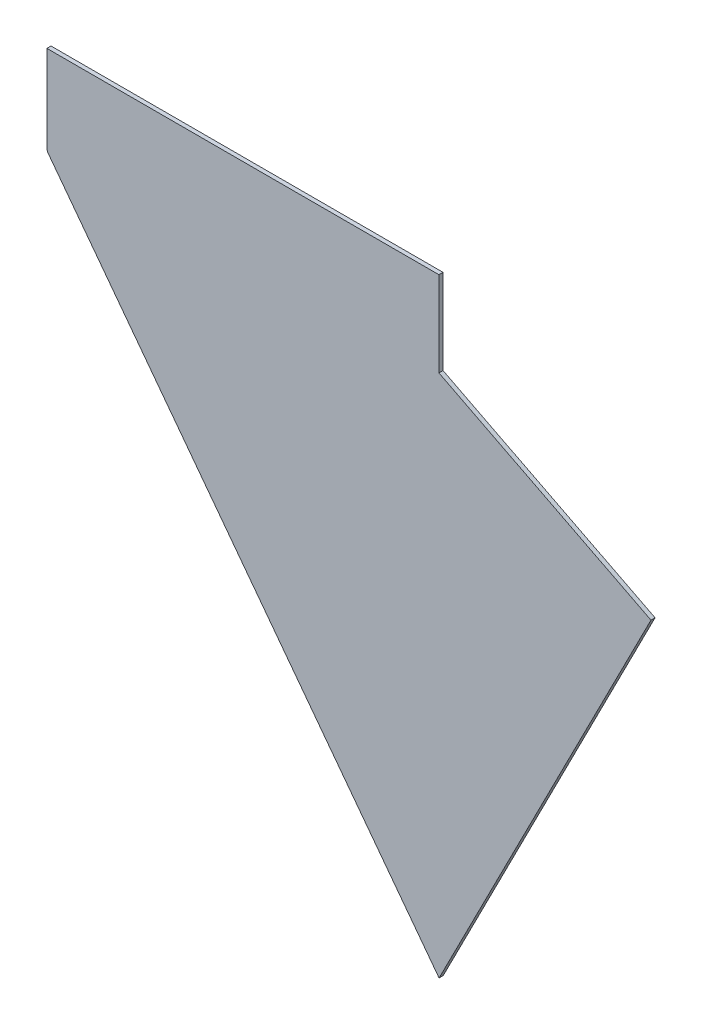
ISO-10303-21;
HEADER;
FILE_DESCRIPTION(('STEP AP214'),'2;1');
FILE_NAME('part.step','',(''),(''),'','','');
FILE_SCHEMA(('AUTOMOTIVE_DESIGN { 1 0 10303 214 1 1 1 1 }'));
ENDSEC;
DATA;
#1=APPLICATION_CONTEXT('core data for automotive mechanical design processes');
#2=APPLICATION_PROTOCOL_DEFINITION('international standard','automotive_design',2000,#1);
#3=PRODUCT_CONTEXT('',#1,'mechanical');
#4=PRODUCT('Part','Part','',(#3));
#5=PRODUCT_RELATED_PRODUCT_CATEGORY('part','',(#4));
#6=PRODUCT_DEFINITION_FORMATION('','',#4);
#7=PRODUCT_DEFINITION_CONTEXT('part definition',#1,'design');
#8=PRODUCT_DEFINITION('design','',#6,#7);
#9=PRODUCT_DEFINITION_SHAPE('','',#8);
#10=(LENGTH_UNIT() NAMED_UNIT(*) SI_UNIT(.MILLI.,.METRE.));
#11=(NAMED_UNIT(*) PLANE_ANGLE_UNIT() SI_UNIT($,.RADIAN.));
#12=(NAMED_UNIT(*) SI_UNIT($,.STERADIAN.) SOLID_ANGLE_UNIT());
#13=UNCERTAINTY_MEASURE_WITH_UNIT(LENGTH_MEASURE(1.E-05),#10,'distance_accuracy_value','');
#14=(GEOMETRIC_REPRESENTATION_CONTEXT(3) GLOBAL_UNCERTAINTY_ASSIGNED_CONTEXT((#13)) GLOBAL_UNIT_ASSIGNED_CONTEXT((#10,
#11,#12)) REPRESENTATION_CONTEXT('',''));
#15=CARTESIAN_POINT('',(0.,0.,0.));
#16=DIRECTION('',(0.,0.,1.));
#17=DIRECTION('',(1.,0.,0.));
#18=AXIS2_PLACEMENT_3D('',#15,#16,#17);
#19=CARTESIAN_POINT('',(-191.151037261948,302.462633045061,101.99999999542));
#20=DIRECTION('',(-0.948323655206207,-0.317304656405071,0.));
#21=DIRECTION('',(0.317304656405071,-0.948323655206206,0.));
#22=AXIS2_PLACEMENT_3D('',#19,#20,#21);
#23=PLANE('',#22);
#24=DIRECTION('',(0.,0.,1.));
#25=VECTOR('',#24,1.);
#26=CARTESIAN_POINT('',(-191.151037261948,302.462633045061,101.99999999542));
#27=LINE('',#26,#25);
#28=CARTESIAN_POINT('',(-191.151037261948,302.462633045061,99.9999999954202));
#29=VERTEX_POINT('',#28);
#30=CARTESIAN_POINT('',(-191.151037261948,302.462633045061,101.99999999542));
#31=VERTEX_POINT('',#30);
#32=EDGE_CURVE('E11',#29,#31,#27,.T.);
#33=ORIENTED_EDGE('',*,*,#32,.F.);
#34=DIRECTION('',(0.317304656405071,-0.948323655206206,0.));
#35=VECTOR('',#34,1.);
#36=CARTESIAN_POINT('',(-191.151037261948,302.462633045061,99.9999999954202));
#37=LINE('',#36,#35);
#38=CARTESIAN_POINT('',(-190.748308282043,301.259002998756,99.9999999954202));
#39=VERTEX_POINT('',#38);
#40=EDGE_CURVE('E102',#29,#39,#37,.T.);
#41=ORIENTED_EDGE('',*,*,#40,.T.);
#42=DIRECTION('',(0.,0.,1.));
#43=VECTOR('',#42,1.);
#44=CARTESIAN_POINT('',(-190.748308282043,301.259002998756,101.99999999542));
#45=LINE('',#44,#43);
#46=CARTESIAN_POINT('',(-190.748308282043,301.259002998756,101.99999999542));
#47=VERTEX_POINT('',#46);
#48=EDGE_CURVE('E48',#39,#47,#45,.T.);
#49=ORIENTED_EDGE('',*,*,#48,.T.);
#50=DIRECTION('',(0.317304656405071,-0.948323655206206,0.));
#51=VECTOR('',#50,1.);
#52=CARTESIAN_POINT('',(-191.151037261948,302.462633045061,101.99999999542));
#53=LINE('',#52,#51);
#54=EDGE_CURVE('E135',#31,#47,#53,.T.);
#55=ORIENTED_EDGE('',*,*,#54,.F.);
#56=EDGE_LOOP('',(#33,#41,#49,#55));
#57=FACE_BOUND('',#56,.T.);
#58=ADVANCED_FACE('F38',(#57),#23,.T.);
#59=CARTESIAN_POINT('',(-190.748308282043,301.259002998756,101.99999999542));
#60=DIRECTION('',(-0.798635510047292,-0.60181502315205,0.));
#61=DIRECTION('',(0.60181502315205,-0.798635510047292,0.));
#62=AXIS2_PLACEMENT_3D('',#59,#60,#61);
#63=PLANE('',#62);
#64=ORIENTED_EDGE('',*,*,#48,.F.);
#65=DIRECTION('',(0.60181502315205,-0.798635510047292,0.));
#66=VECTOR('',#65,1.);
#67=CARTESIAN_POINT('',(-190.748308282043,301.259002998756,99.9999999954202));
#68=LINE('',#67,#66);
#69=CARTESIAN_POINT('',(-0.435626229987367,48.7055437928855,99.9999999954202));
#70=VERTEX_POINT('',#69);
#71=EDGE_CURVE('E118',#39,#70,#68,.T.);
#72=ORIENTED_EDGE('',*,*,#71,.T.);
#73=DIRECTION('',(0.,0.,1.));
#74=VECTOR('',#73,1.);
#75=CARTESIAN_POINT('',(-0.435626229987367,48.7055437928855,101.99999999542));
#76=LINE('',#75,#74);
#77=CARTESIAN_POINT('',(-0.435626229987367,48.7055437928855,101.99999999542));
#78=VERTEX_POINT('',#77);
#79=EDGE_CURVE('E128',#70,#78,#76,.T.);
#80=ORIENTED_EDGE('',*,*,#79,.T.);
#81=DIRECTION('',(0.60181502315205,-0.798635510047292,0.));
#82=VECTOR('',#81,1.);
#83=CARTESIAN_POINT('',(-190.748308282043,301.259002998756,101.99999999542));
#84=LINE('',#83,#82);
#85=EDGE_CURVE('E144',#47,#78,#84,.T.);
#86=ORIENTED_EDGE('',*,*,#85,.F.);
#87=EDGE_LOOP('',(#64,#72,#80,#86));
#88=FACE_BOUND('',#87,.T.);
#89=ADVANCED_FACE('F147',(#88),#63,.T.);
#90=CARTESIAN_POINT('',(-0.435626229987367,48.7055437928855,101.99999999542));
#91=DIRECTION('',(0.891006524269927,-0.453990499579478,0.));
#92=DIRECTION('',(0.453990499579478,0.891006524269927,0.));
#93=AXIS2_PLACEMENT_3D('',#90,#91,#92);
#94=PLANE('',#93);
#95=ORIENTED_EDGE('',*,*,#79,.F.);
#96=DIRECTION('',(0.453990499579478,0.891006524269927,0.));
#97=VECTOR('',#96,1.);
#98=CARTESIAN_POINT('',(-0.435626229987367,48.7055437928855,99.9999999954202));
#99=LINE('',#98,#97);
#100=CARTESIAN_POINT('',(102.615356420228,250.95448503465,99.9999999954202));
#101=VERTEX_POINT('',#100);
#102=EDGE_CURVE('E115',#70,#101,#99,.T.);
#103=ORIENTED_EDGE('',*,*,#102,.T.);
#104=DIRECTION('',(0.,0.,1.));
#105=VECTOR('',#104,1.);
#106=CARTESIAN_POINT('',(102.615356420228,250.95448503465,101.99999999542));
#107=LINE('',#106,#105);
#108=CARTESIAN_POINT('',(102.615356420228,250.95448503465,101.99999999542));
#109=VERTEX_POINT('',#108);
#110=EDGE_CURVE('E125',#101,#109,#107,.T.);
#111=ORIENTED_EDGE('',*,*,#110,.T.);
#112=DIRECTION('',(0.453990499579478,0.891006524269927,0.));
#113=VECTOR('',#112,1.);
#114=CARTESIAN_POINT('',(-0.435626229987367,48.7055437928855,101.99999999542));
#115=LINE('',#114,#113);
#116=EDGE_CURVE('E148',#78,#109,#115,.T.);
#117=ORIENTED_EDGE('',*,*,#116,.F.);
#118=EDGE_LOOP('',(#95,#103,#111,#117));
#119=FACE_BOUND('',#118,.T.);
#120=ADVANCED_FACE('F162',(#119),#94,.T.);
#121=CARTESIAN_POINT('',(102.615356420228,250.95448503465,101.99999999542));
#122=DIRECTION('',(0.453990499579478,0.891006524269927,0.));
#123=DIRECTION('',(-0.891006524269927,0.453990499579478,0.));
#124=AXIS2_PLACEMENT_3D('',#121,#122,#123);
#125=PLANE('',#124);
#126=ORIENTED_EDGE('',*,*,#110,.F.);
#127=DIRECTION('',(-0.891006524269927,0.453990499579478,0.));
#128=VECTOR('',#127,1.);
#129=CARTESIAN_POINT('',(102.615356420228,250.95448503465,99.9999999954202));
#130=LINE('',#129,#128);
#131=CARTESIAN_POINT('',(-0.509928140672638,303.499441981448,99.9999999954202));
#132=VERTEX_POINT('',#131);
#133=EDGE_CURVE('E112',#101,#132,#130,.T.);
#134=ORIENTED_EDGE('',*,*,#133,.T.);
#135=DIRECTION('',(0.,0.,1.));
#136=VECTOR('',#135,1.);
#137=CARTESIAN_POINT('',(-0.509928140672638,303.499441981448,101.99999999542));
#138=LINE('',#137,#136);
#139=CARTESIAN_POINT('',(-0.509928140672638,303.499441981448,101.99999999542));
#140=VERTEX_POINT('',#139);
#141=EDGE_CURVE('E123',#132,#140,#138,.T.);
#142=ORIENTED_EDGE('',*,*,#141,.T.);
#143=DIRECTION('',(-0.891006524269927,0.453990499579478,0.));
#144=VECTOR('',#143,1.);
#145=CARTESIAN_POINT('',(102.615356420228,250.95448503465,101.99999999542));
#146=LINE('',#145,#144);
#147=EDGE_CURVE('E150',#109,#140,#146,.T.);
#148=ORIENTED_EDGE('',*,*,#147,.F.);
#149=EDGE_LOOP('',(#126,#134,#142,#148));
#150=FACE_BOUND('',#149,.T.);
#151=ADVANCED_FACE('F159',(#150),#125,.T.);
#152=CARTESIAN_POINT('',(-0.509928140672638,303.499441981448,101.99999999542));
#153=DIRECTION('',(1.,0.,0.));
#154=DIRECTION('',(0.,1.,0.));
#155=AXIS2_PLACEMENT_3D('',#152,#153,#154);
#156=PLANE('',#155);
#157=ORIENTED_EDGE('',*,*,#141,.F.);
#158=DIRECTION('',(0.,1.,0.));
#159=VECTOR('',#158,1.);
#160=CARTESIAN_POINT('',(-0.509928140672638,0.,99.9999999954202));
#161=LINE('',#160,#159);
#162=CARTESIAN_POINT('',(-0.509928140672666,344.875447906096,99.9999999954202));
#163=VERTEX_POINT('',#162);
#164=EDGE_CURVE('E109',#132,#163,#161,.T.);
#165=ORIENTED_EDGE('',*,*,#164,.T.);
#166=DIRECTION('',(0.,0.,1.));
#167=VECTOR('',#166,1.);
#168=CARTESIAN_POINT('',(-0.509928140672666,344.875447906096,101.99999999542));
#169=LINE('',#168,#167);
#170=CARTESIAN_POINT('',(-0.509928140672666,344.875447906096,101.99999999542));
#171=VERTEX_POINT('',#170);
#172=EDGE_CURVE('E56',#163,#171,#169,.T.);
#173=ORIENTED_EDGE('',*,*,#172,.T.);
#174=DIRECTION('',(0.,1.,0.));
#175=VECTOR('',#174,1.);
#176=CARTESIAN_POINT('',(-0.509928140672638,303.499441981448,101.99999999542));
#177=LINE('',#176,#175);
#178=EDGE_CURVE('E95',#140,#171,#177,.T.);
#179=ORIENTED_EDGE('',*,*,#178,.F.);
#180=EDGE_LOOP('',(#157,#165,#173,#179));
#181=FACE_BOUND('',#180,.T.);
#182=ADVANCED_FACE('F156',(#181),#156,.T.);
#183=CARTESIAN_POINT('',(-191.151037261948,344.875447906096,101.99999999542));
#184=DIRECTION('',(0.,1.,0.));
#185=DIRECTION('',(-1.,0.,0.));
#186=AXIS2_PLACEMENT_3D('',#183,#184,#185);
#187=PLANE('',#186);
#188=ORIENTED_EDGE('',*,*,#172,.F.);
#189=DIRECTION('',(1.,0.,0.));
#190=VECTOR('',#189,1.);
#191=CARTESIAN_POINT('',(0.,344.875447906096,99.9999999954202));
#192=LINE('',#191,#190);
#193=CARTESIAN_POINT('',(-191.151037261948,344.875447906096,99.9999999954202));
#194=VERTEX_POINT('',#193);
#195=EDGE_CURVE('E100',#163,#194,#192,.F.);
#196=ORIENTED_EDGE('',*,*,#195,.T.);
#197=DIRECTION('',(0.,0.,1.));
#198=VECTOR('',#197,1.);
#199=CARTESIAN_POINT('',(-191.151037261948,344.875447906096,101.99999999542));
#200=LINE('',#199,#198);
#201=CARTESIAN_POINT('',(-191.151037261948,344.875447906096,101.99999999542));
#202=VERTEX_POINT('',#201);
#203=EDGE_CURVE('E42',#194,#202,#200,.T.);
#204=ORIENTED_EDGE('',*,*,#203,.T.);
#205=DIRECTION('',(-1.,0.,0.));
#206=VECTOR('',#205,1.);
#207=CARTESIAN_POINT('',(-191.151037261948,344.875447906096,101.99999999542));
#208=LINE('',#207,#206);
#209=EDGE_CURVE('E111',#171,#202,#208,.T.);
#210=ORIENTED_EDGE('',*,*,#209,.F.);
#211=EDGE_LOOP('',(#188,#196,#204,#210));
#212=FACE_BOUND('',#211,.T.);
#213=ADVANCED_FACE('F104',(#212),#187,.T.);
#214=CARTESIAN_POINT('',(-191.151037261948,344.875447906096,101.99999999542));
#215=DIRECTION('',(-1.,0.,0.));
#216=DIRECTION('',(0.,-1.,0.));
#217=AXIS2_PLACEMENT_3D('',#214,#215,#216);
#218=PLANE('',#217);
#219=DIRECTION('',(0.,1.,0.));
#220=VECTOR('',#219,1.);
#221=CARTESIAN_POINT('',(-191.151037261948,0.,99.9999999954202));
#222=LINE('',#221,#220);
#223=EDGE_CURVE('E89',#194,#29,#222,.F.);
#224=ORIENTED_EDGE('',*,*,#223,.T.);
#225=ORIENTED_EDGE('',*,*,#32,.T.);
#226=DIRECTION('',(0.,-1.,0.));
#227=VECTOR('',#226,1.);
#228=CARTESIAN_POINT('',(-191.151037261948,344.875447906096,101.99999999542));
#229=LINE('',#228,#227);
#230=EDGE_CURVE('E91',#202,#31,#229,.T.);
#231=ORIENTED_EDGE('',*,*,#230,.F.);
#232=ORIENTED_EDGE('',*,*,#203,.F.);
#233=EDGE_LOOP('',(#224,#225,#231,#232));
#234=FACE_BOUND('',#233,.T.);
#235=ADVANCED_FACE('F40',(#234),#218,.T.);
#236=CARTESIAN_POINT('',(0.,0.,101.99999999542));
#237=DIRECTION('',(0.,0.,1.));
#238=DIRECTION('',(1.,0.,0.));
#239=AXIS2_PLACEMENT_3D('',#236,#237,#238);
#240=PLANE('',#239);
#241=ORIENTED_EDGE('',*,*,#209,.T.);
#242=ORIENTED_EDGE('',*,*,#230,.T.);
#243=ORIENTED_EDGE('',*,*,#54,.T.);
#244=ORIENTED_EDGE('',*,*,#85,.T.);
#245=ORIENTED_EDGE('',*,*,#116,.T.);
#246=ORIENTED_EDGE('',*,*,#147,.T.);
#247=ORIENTED_EDGE('',*,*,#178,.T.);
#248=EDGE_LOOP('',(#241,#242,#243,#244,#245,#246,#247));
#249=FACE_BOUND('',#248,.T.);
#250=ADVANCED_FACE('F142',(#249),#240,.T.);
#251=CARTESIAN_POINT('',(0.,0.,99.9999999954202));
#252=DIRECTION('',(0.,0.,1.));
#253=DIRECTION('',(1.,0.,0.));
#254=AXIS2_PLACEMENT_3D('',#251,#252,#253);
#255=PLANE('',#254);
#256=ORIENTED_EDGE('',*,*,#195,.F.);
#257=ORIENTED_EDGE('',*,*,#164,.F.);
#258=ORIENTED_EDGE('',*,*,#133,.F.);
#259=ORIENTED_EDGE('',*,*,#102,.F.);
#260=ORIENTED_EDGE('',*,*,#71,.F.);
#261=ORIENTED_EDGE('',*,*,#40,.F.);
#262=ORIENTED_EDGE('',*,*,#223,.F.);
#263=EDGE_LOOP('',(#256,#257,#258,#259,#260,#261,#262));
#264=FACE_BOUND('',#263,.T.);
#265=ADVANCED_FACE('F98',(#264),#255,.F.);
#266=CLOSED_SHELL('',(#58,#89,#120,#151,#182,#213,#235,#250,#265));
#267=MANIFOLD_SOLID_BREP('B2',#266);
#268=ADVANCED_BREP_SHAPE_REPRESENTATION('',(#18,#267),#14);
#269=SHAPE_DEFINITION_REPRESENTATION(#9,#268);
ENDSEC;
END-ISO-10303-21;
